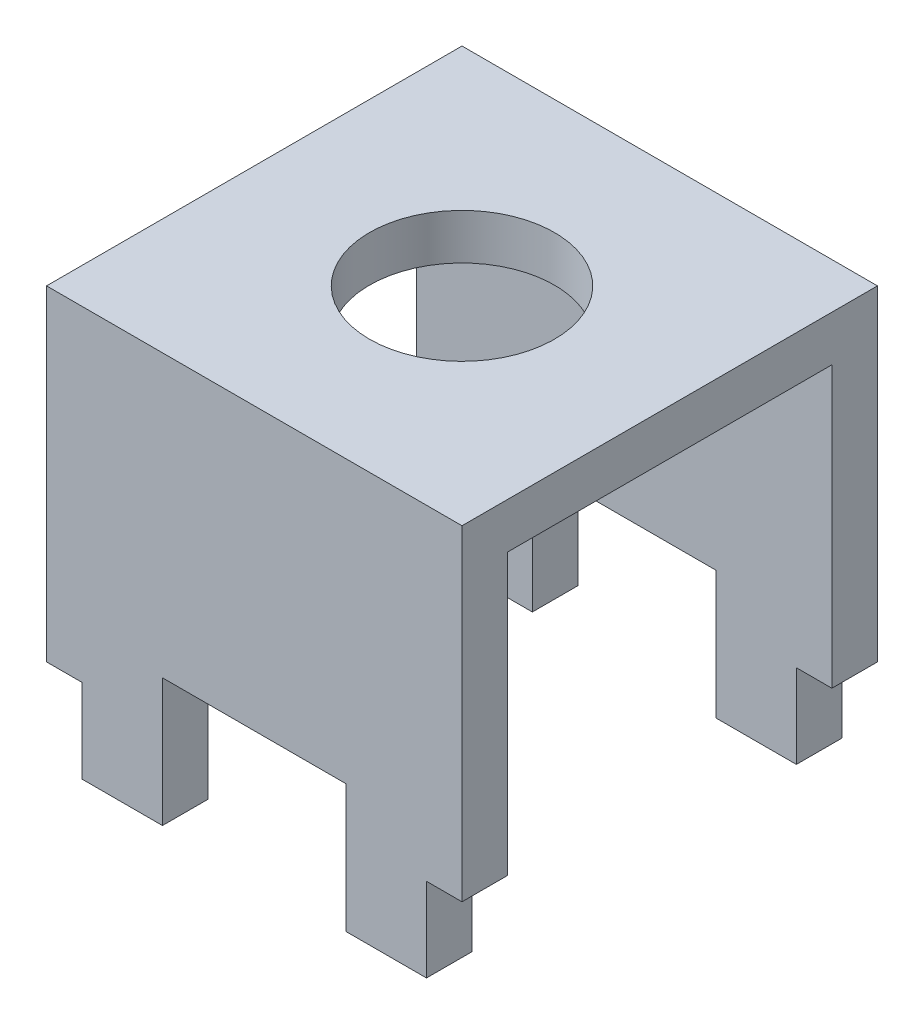
ISO-10303-21;
HEADER;
FILE_DESCRIPTION(('STEP AP214'),'2;1');
FILE_NAME('part.step','',(''),(''),'','','');
FILE_SCHEMA(('AUTOMOTIVE_DESIGN { 1 0 10303 214 1 1 1 1 }'));
ENDSEC;
DATA;
#1=APPLICATION_CONTEXT('core data for automotive mechanical design processes');
#2=APPLICATION_PROTOCOL_DEFINITION('international standard','automotive_design',2000,#1);
#3=PRODUCT_CONTEXT('',#1,'mechanical');
#4=PRODUCT('Part','Part','',(#3));
#5=PRODUCT_RELATED_PRODUCT_CATEGORY('part','',(#4));
#6=PRODUCT_DEFINITION_FORMATION('','',#4);
#7=PRODUCT_DEFINITION_CONTEXT('part definition',#1,'design');
#8=PRODUCT_DEFINITION('design','',#6,#7);
#9=PRODUCT_DEFINITION_SHAPE('','',#8);
#10=(LENGTH_UNIT() NAMED_UNIT(*) SI_UNIT(.MILLI.,.METRE.));
#11=(NAMED_UNIT(*) PLANE_ANGLE_UNIT() SI_UNIT($,.RADIAN.));
#12=(NAMED_UNIT(*) SI_UNIT($,.STERADIAN.) SOLID_ANGLE_UNIT());
#13=UNCERTAINTY_MEASURE_WITH_UNIT(LENGTH_MEASURE(1.E-05),#10,'distance_accuracy_value','');
#14=(GEOMETRIC_REPRESENTATION_CONTEXT(3) GLOBAL_UNCERTAINTY_ASSIGNED_CONTEXT((#13)) GLOBAL_UNIT_ASSIGNED_CONTEXT((#10,
#11,#12)) REPRESENTATION_CONTEXT('',''));
#15=CARTESIAN_POINT('',(0.,0.,0.));
#16=DIRECTION('',(0.,0.,1.));
#17=DIRECTION('',(1.,0.,0.));
#18=AXIS2_PLACEMENT_3D('',#15,#16,#17);
#19=CARTESIAN_POINT('',(-1.7399,5.842,-6.35));
#20=DIRECTION('',(-1.,0.,0.));
#21=DIRECTION('',(0.,0.,1.));
#22=AXIS2_PLACEMENT_3D('',#19,#20,#21);
#23=PLANE('',#22);
#24=DIRECTION('',(0.,1.,0.));
#25=VECTOR('',#24,1.);
#26=CARTESIAN_POINT('',(-1.7399,0.,-3.0734));
#27=LINE('',#26,#25);
#28=CARTESIAN_POINT('',(-1.7399,5.842,-3.0734));
#29=VERTEX_POINT('',#28);
#30=CARTESIAN_POINT('',(-1.7399,3.4163,-3.0734));
#31=VERTEX_POINT('',#30);
#32=EDGE_CURVE('E348',#29,#31,#27,.F.);
#33=ORIENTED_EDGE('',*,*,#32,.T.);
#34=DIRECTION('',(0.,0.,1.));
#35=VECTOR('',#34,1.);
#36=CARTESIAN_POINT('',(-1.7399,3.4163,-5.1317219367007));
#37=LINE('',#36,#35);
#38=CARTESIAN_POINT('',(-1.7399,3.4163,-3.937));
#39=VERTEX_POINT('',#38);
#40=EDGE_CURVE('E228',#31,#39,#37,.F.);
#41=ORIENTED_EDGE('',*,*,#40,.T.);
#42=DIRECTION('',(0.,1.,0.));
#43=VECTOR('',#42,1.);
#44=CARTESIAN_POINT('',(-1.7399,0.,-3.937));
#45=LINE('',#44,#43);
#46=CARTESIAN_POINT('',(-1.7399,5.842,-3.937));
#47=VERTEX_POINT('',#46);
#48=EDGE_CURVE('E323',#47,#39,#45,.F.);
#49=ORIENTED_EDGE('',*,*,#48,.F.);
#50=DIRECTION('',(0.,0.,1.));
#51=VECTOR('',#50,1.);
#52=CARTESIAN_POINT('',(-1.7399,5.842,-6.35));
#53=LINE('',#52,#51);
#54=EDGE_CURVE('E218',#47,#29,#53,.T.);
#55=ORIENTED_EDGE('',*,*,#54,.T.);
#56=EDGE_LOOP('',(#33,#41,#49,#55));
#57=FACE_BOUND('',#56,.T.);
#58=ADVANCED_FACE('F16',(#57),#23,.F.);
#59=CARTESIAN_POINT('',(3.937,3.4163,-5.1317219367007));
#60=DIRECTION('',(0.,1.,0.));
#61=DIRECTION('',(0.,0.,1.));
#62=AXIS2_PLACEMENT_3D('',#59,#60,#61);
#63=PLANE('',#62);
#64=DIRECTION('',(0.,0.,-1.));
#65=VECTOR('',#64,1.);
#66=CARTESIAN_POINT('',(-3.2639,3.4163,-6.35));
#67=LINE('',#66,#65);
#68=CARTESIAN_POINT('',(-3.2639,3.4163,-3.0734));
#69=VERTEX_POINT('',#68);
#70=CARTESIAN_POINT('',(-3.2639,3.4163,-3.937));
#71=VERTEX_POINT('',#70);
#72=EDGE_CURVE('E226',#69,#71,#67,.T.);
#73=ORIENTED_EDGE('',*,*,#72,.T.);
#74=DIRECTION('',(-1.,0.,0.));
#75=VECTOR('',#74,1.);
#76=CARTESIAN_POINT('',(-3.937,3.4163,-3.937));
#77=LINE('',#76,#75);
#78=EDGE_CURVE('E320',#39,#71,#77,.T.);
#79=ORIENTED_EDGE('',*,*,#78,.F.);
#80=ORIENTED_EDGE('',*,*,#40,.F.);
#81=DIRECTION('',(-1.,0.,0.));
#82=VECTOR('',#81,1.);
#83=CARTESIAN_POINT('',(-6.35,3.4163,-3.0734));
#84=LINE('',#83,#82);
#85=EDGE_CURVE('E346',#31,#69,#84,.T.);
#86=ORIENTED_EDGE('',*,*,#85,.T.);
#87=EDGE_LOOP('',(#73,#79,#80,#86));
#88=FACE_BOUND('',#87,.T.);
#89=ADVANCED_FACE('F617',(#88),#63,.F.);
#90=CARTESIAN_POINT('',(-3.2639,0.,-6.35));
#91=DIRECTION('',(1.,0.,0.));
#92=DIRECTION('',(0.,0.,-1.));
#93=AXIS2_PLACEMENT_3D('',#90,#91,#92);
#94=PLANE('',#93);
#95=DIRECTION('',(0.,1.,0.));
#96=VECTOR('',#95,1.);
#97=CARTESIAN_POINT('',(-3.2639,0.,-3.937));
#98=LINE('',#97,#96);
#99=CARTESIAN_POINT('',(-3.2639,5.0038,-3.937));
#100=VERTEX_POINT('',#99);
#101=EDGE_CURVE('E317',#71,#100,#98,.T.);
#102=ORIENTED_EDGE('',*,*,#101,.F.);
#103=ORIENTED_EDGE('',*,*,#72,.F.);
#104=DIRECTION('',(0.,1.,0.));
#105=VECTOR('',#104,1.);
#106=CARTESIAN_POINT('',(-3.2639,0.,-3.0734));
#107=LINE('',#106,#105);
#108=CARTESIAN_POINT('',(-3.2639,5.0038,-3.0734));
#109=VERTEX_POINT('',#108);
#110=EDGE_CURVE('E344',#69,#109,#107,.T.);
#111=ORIENTED_EDGE('',*,*,#110,.T.);
#112=DIRECTION('',(0.,0.,1.));
#113=VECTOR('',#112,1.);
#114=CARTESIAN_POINT('',(-3.2639,5.0038,-6.35));
#115=LINE('',#114,#113);
#116=EDGE_CURVE('E195',#109,#100,#115,.F.);
#117=ORIENTED_EDGE('',*,*,#116,.T.);
#118=EDGE_LOOP('',(#102,#103,#111,#117));
#119=FACE_BOUND('',#118,.T.);
#120=ADVANCED_FACE('F608',(#119),#94,.F.);
#121=CARTESIAN_POINT('',(3.2639,5.0038,-6.35));
#122=DIRECTION('',(-1.,0.,0.));
#123=DIRECTION('',(0.,0.,1.));
#124=AXIS2_PLACEMENT_3D('',#121,#122,#123);
#125=PLANE('',#124);
#126=DIRECTION('',(0.,1.,0.));
#127=VECTOR('',#126,1.);
#128=CARTESIAN_POINT('',(3.2639,0.,-3.0734));
#129=LINE('',#128,#127);
#130=CARTESIAN_POINT('',(3.2639,5.0038,-3.0734));
#131=VERTEX_POINT('',#130);
#132=CARTESIAN_POINT('',(3.2639,3.4163,-3.0734));
#133=VERTEX_POINT('',#132);
#134=EDGE_CURVE('E338',#131,#133,#129,.F.);
#135=ORIENTED_EDGE('',*,*,#134,.T.);
#136=DIRECTION('',(0.,0.,1.));
#137=VECTOR('',#136,1.);
#138=CARTESIAN_POINT('',(3.2639,3.4163,-5.1317219367007));
#139=LINE('',#138,#137);
#140=CARTESIAN_POINT('',(3.2639,3.4163,-3.937));
#141=VERTEX_POINT('',#140);
#142=EDGE_CURVE('E224',#133,#141,#139,.F.);
#143=ORIENTED_EDGE('',*,*,#142,.T.);
#144=DIRECTION('',(0.,1.,0.));
#145=VECTOR('',#144,1.);
#146=CARTESIAN_POINT('',(3.2639,0.,-3.937));
#147=LINE('',#146,#145);
#148=CARTESIAN_POINT('',(3.2639,5.0038,-3.937));
#149=VERTEX_POINT('',#148);
#150=EDGE_CURVE('E308',#149,#141,#147,.F.);
#151=ORIENTED_EDGE('',*,*,#150,.F.);
#152=DIRECTION('',(0.,0.,1.));
#153=VECTOR('',#152,1.);
#154=CARTESIAN_POINT('',(3.2639,5.0038,-6.35));
#155=LINE('',#154,#153);
#156=EDGE_CURVE('E326',#149,#131,#155,.T.);
#157=ORIENTED_EDGE('',*,*,#156,.T.);
#158=EDGE_LOOP('',(#135,#143,#151,#157));
#159=FACE_BOUND('',#158,.T.);
#160=ADVANCED_FACE('F599',(#159),#125,.F.);
#161=CARTESIAN_POINT('',(3.937,3.4163,-5.1317219367007));
#162=DIRECTION('',(0.,1.,0.));
#163=DIRECTION('',(0.,0.,1.));
#164=AXIS2_PLACEMENT_3D('',#161,#162,#163);
#165=PLANE('',#164);
#166=DIRECTION('',(0.,0.,-1.));
#167=VECTOR('',#166,1.);
#168=CARTESIAN_POINT('',(1.7399,3.4163,-6.35));
#169=LINE('',#168,#167);
#170=CARTESIAN_POINT('',(1.7399,3.4163,-3.0734));
#171=VERTEX_POINT('',#170);
#172=CARTESIAN_POINT('',(1.7399,3.4163,-3.937));
#173=VERTEX_POINT('',#172);
#174=EDGE_CURVE('E222',#171,#173,#169,.T.);
#175=ORIENTED_EDGE('',*,*,#174,.T.);
#176=DIRECTION('',(-1.,0.,0.));
#177=VECTOR('',#176,1.);
#178=CARTESIAN_POINT('',(-3.937,3.4163,-3.937));
#179=LINE('',#178,#177);
#180=EDGE_CURVE('E305',#141,#173,#179,.T.);
#181=ORIENTED_EDGE('',*,*,#180,.F.);
#182=ORIENTED_EDGE('',*,*,#142,.F.);
#183=DIRECTION('',(-1.,0.,0.));
#184=VECTOR('',#183,1.);
#185=CARTESIAN_POINT('',(-6.35,3.4163,-3.0734));
#186=LINE('',#185,#184);
#187=EDGE_CURVE('E336',#133,#171,#186,.T.);
#188=ORIENTED_EDGE('',*,*,#187,.T.);
#189=EDGE_LOOP('',(#175,#181,#182,#188));
#190=FACE_BOUND('',#189,.T.);
#191=ADVANCED_FACE('F590',(#190),#165,.F.);
#192=CARTESIAN_POINT('',(1.7399,0.,-6.35));
#193=DIRECTION('',(1.,0.,0.));
#194=DIRECTION('',(0.,0.,-1.));
#195=AXIS2_PLACEMENT_3D('',#192,#193,#194);
#196=PLANE('',#195);
#197=DIRECTION('',(0.,1.,0.));
#198=VECTOR('',#197,1.);
#199=CARTESIAN_POINT('',(1.7399,0.,-3.937));
#200=LINE('',#199,#198);
#201=CARTESIAN_POINT('',(1.7399,5.842,-3.937));
#202=VERTEX_POINT('',#201);
#203=EDGE_CURVE('E302',#173,#202,#200,.T.);
#204=ORIENTED_EDGE('',*,*,#203,.F.);
#205=ORIENTED_EDGE('',*,*,#174,.F.);
#206=DIRECTION('',(0.,1.,0.));
#207=VECTOR('',#206,1.);
#208=CARTESIAN_POINT('',(1.7399,0.,-3.0734));
#209=LINE('',#208,#207);
#210=CARTESIAN_POINT('',(1.7399,5.842,-3.0734));
#211=VERTEX_POINT('',#210);
#212=EDGE_CURVE('E334',#171,#211,#209,.T.);
#213=ORIENTED_EDGE('',*,*,#212,.T.);
#214=DIRECTION('',(0.,0.,1.));
#215=VECTOR('',#214,1.);
#216=CARTESIAN_POINT('',(1.7399,5.842,-6.35));
#217=LINE('',#216,#215);
#218=EDGE_CURVE('E220',#211,#202,#217,.F.);
#219=ORIENTED_EDGE('',*,*,#218,.T.);
#220=EDGE_LOOP('',(#204,#205,#213,#219));
#221=FACE_BOUND('',#220,.T.);
#222=ADVANCED_FACE('F581',(#221),#196,.F.);
#223=CARTESIAN_POINT('',(1.7399,5.842,-6.35));
#224=DIRECTION('',(0.,1.,0.));
#225=DIRECTION('',(0.,0.,1.));
#226=AXIS2_PLACEMENT_3D('',#223,#224,#225);
#227=PLANE('',#226);
#228=ORIENTED_EDGE('',*,*,#54,.F.);
#229=DIRECTION('',(-1.,0.,0.));
#230=VECTOR('',#229,1.);
#231=CARTESIAN_POINT('',(-3.937,5.842,-3.937));
#232=LINE('',#231,#230);
#233=EDGE_CURVE('E299',#202,#47,#232,.T.);
#234=ORIENTED_EDGE('',*,*,#233,.F.);
#235=ORIENTED_EDGE('',*,*,#218,.F.);
#236=DIRECTION('',(-1.,0.,0.));
#237=VECTOR('',#236,1.);
#238=CARTESIAN_POINT('',(-6.35,5.842,-3.0734));
#239=LINE('',#238,#237);
#240=EDGE_CURVE('E331',#211,#29,#239,.T.);
#241=ORIENTED_EDGE('',*,*,#240,.T.);
#242=EDGE_LOOP('',(#228,#234,#235,#241));
#243=FACE_BOUND('',#242,.T.);
#244=ADVANCED_FACE('F572',(#243),#227,.F.);
#245=CARTESIAN_POINT('',(-3.2639,5.0038,-6.35));
#246=DIRECTION('',(0.,1.,0.));
#247=DIRECTION('',(0.,0.,1.));
#248=AXIS2_PLACEMENT_3D('',#245,#246,#247);
#249=PLANE('',#248);
#250=DIRECTION('',(-1.,0.,0.));
#251=VECTOR('',#250,1.);
#252=CARTESIAN_POINT('',(-6.35,5.0038,-3.0734));
#253=LINE('',#252,#251);
#254=CARTESIAN_POINT('',(-3.937,5.0038,-3.0734));
#255=VERTEX_POINT('',#254);
#256=EDGE_CURVE('E342',#109,#255,#253,.T.);
#257=ORIENTED_EDGE('',*,*,#256,.T.);
#258=DIRECTION('',(0.,0.,-1.));
#259=VECTOR('',#258,1.);
#260=CARTESIAN_POINT('',(-3.937,5.0038,0.));
#261=LINE('',#260,#259);
#262=CARTESIAN_POINT('',(-3.937,5.0038,-3.937));
#263=VERTEX_POINT('',#262);
#264=EDGE_CURVE('E288',#255,#263,#261,.T.);
#265=ORIENTED_EDGE('',*,*,#264,.T.);
#266=DIRECTION('',(-1.,0.,0.));
#267=VECTOR('',#266,1.);
#268=CARTESIAN_POINT('',(-3.937,5.0038,-3.937));
#269=LINE('',#268,#267);
#270=EDGE_CURVE('E314',#100,#263,#269,.T.);
#271=ORIENTED_EDGE('',*,*,#270,.F.);
#272=ORIENTED_EDGE('',*,*,#116,.F.);
#273=EDGE_LOOP('',(#257,#265,#271,#272));
#274=FACE_BOUND('',#273,.T.);
#275=ADVANCED_FACE('F564',(#274),#249,.F.);
#276=CARTESIAN_POINT('',(-3.2639,0.,-6.35));
#277=DIRECTION('',(1.,0.,0.));
#278=DIRECTION('',(0.,0.,-1.));
#279=AXIS2_PLACEMENT_3D('',#276,#277,#278);
#280=PLANE('',#279);
#281=DIRECTION('',(0.,1.,0.));
#282=VECTOR('',#281,1.);
#283=CARTESIAN_POINT('',(-3.2639,10.3124,3.0734));
#284=LINE('',#283,#282);
#285=CARTESIAN_POINT('',(-3.2639,5.0038,3.0734));
#286=VERTEX_POINT('',#285);
#287=CARTESIAN_POINT('',(-3.2639,3.4163,3.0734));
#288=VERTEX_POINT('',#287);
#289=EDGE_CURVE('E177',#286,#288,#284,.F.);
#290=ORIENTED_EDGE('',*,*,#289,.T.);
#291=DIRECTION('',(0.,0.,1.));
#292=VECTOR('',#291,1.);
#293=CARTESIAN_POINT('',(-3.2639,3.4163,-5.1317219367007));
#294=LINE('',#293,#292);
#295=CARTESIAN_POINT('',(-3.2639,3.4163,3.937));
#296=VERTEX_POINT('',#295);
#297=EDGE_CURVE('E180',#288,#296,#294,.T.);
#298=ORIENTED_EDGE('',*,*,#297,.T.);
#299=DIRECTION('',(0.,1.,0.));
#300=VECTOR('',#299,1.);
#301=CARTESIAN_POINT('',(-3.2639,11.176,3.937));
#302=LINE('',#301,#300);
#303=CARTESIAN_POINT('',(-3.2639,5.0038,3.937));
#304=VERTEX_POINT('',#303);
#305=EDGE_CURVE('E284',#304,#296,#302,.F.);
#306=ORIENTED_EDGE('',*,*,#305,.F.);
#307=DIRECTION('',(0.,0.,1.));
#308=VECTOR('',#307,1.);
#309=CARTESIAN_POINT('',(-3.2639,5.0038,-6.35));
#310=LINE('',#309,#308);
#311=EDGE_CURVE('E174',#304,#286,#310,.F.);
#312=ORIENTED_EDGE('',*,*,#311,.T.);
#313=EDGE_LOOP('',(#290,#298,#306,#312));
#314=FACE_BOUND('',#313,.T.);
#315=ADVANCED_FACE('F179',(#314),#280,.F.);
#316=CARTESIAN_POINT('',(3.937,3.4163,-5.1317219367007));
#317=DIRECTION('',(0.,1.,0.));
#318=DIRECTION('',(0.,0.,1.));
#319=AXIS2_PLACEMENT_3D('',#316,#317,#318);
#320=PLANE('',#319);
#321=DIRECTION('',(0.,0.,1.));
#322=VECTOR('',#321,1.);
#323=CARTESIAN_POINT('',(-1.7399,3.4163,-6.35));
#324=LINE('',#323,#322);
#325=CARTESIAN_POINT('',(-1.7399,3.4163,3.0734));
#326=VERTEX_POINT('',#325);
#327=CARTESIAN_POINT('',(-1.7399,3.4163,3.937));
#328=VERTEX_POINT('',#327);
#329=EDGE_CURVE('E194',#326,#328,#324,.T.);
#330=ORIENTED_EDGE('',*,*,#329,.T.);
#331=DIRECTION('',(1.,0.,0.));
#332=VECTOR('',#331,1.);
#333=CARTESIAN_POINT('',(-3.937,3.4163,3.937));
#334=LINE('',#333,#332);
#335=EDGE_CURVE('E192',#296,#328,#334,.T.);
#336=ORIENTED_EDGE('',*,*,#335,.F.);
#337=ORIENTED_EDGE('',*,*,#297,.F.);
#338=DIRECTION('',(1.,0.,0.));
#339=VECTOR('',#338,1.);
#340=CARTESIAN_POINT('',(-6.35,3.4163,3.0734));
#341=LINE('',#340,#339);
#342=EDGE_CURVE('E185',#288,#326,#341,.T.);
#343=ORIENTED_EDGE('',*,*,#342,.T.);
#344=EDGE_LOOP('',(#330,#336,#337,#343));
#345=FACE_BOUND('',#344,.T.);
#346=ADVANCED_FACE('F189',(#345),#320,.F.);
#347=CARTESIAN_POINT('',(-1.7399,5.842,-6.35));
#348=DIRECTION('',(-1.,0.,0.));
#349=DIRECTION('',(0.,0.,1.));
#350=AXIS2_PLACEMENT_3D('',#347,#348,#349);
#351=PLANE('',#350);
#352=DIRECTION('',(0.,1.,0.));
#353=VECTOR('',#352,1.);
#354=CARTESIAN_POINT('',(-1.7399,11.176,3.937));
#355=LINE('',#354,#353);
#356=CARTESIAN_POINT('',(-1.7399,5.842,3.937));
#357=VERTEX_POINT('',#356);
#358=EDGE_CURVE('E280',#328,#357,#355,.T.);
#359=ORIENTED_EDGE('',*,*,#358,.F.);
#360=ORIENTED_EDGE('',*,*,#329,.F.);
#361=DIRECTION('',(0.,1.,0.));
#362=VECTOR('',#361,1.);
#363=CARTESIAN_POINT('',(-1.7399,10.3124,3.0734));
#364=LINE('',#363,#362);
#365=CARTESIAN_POINT('',(-1.7399,5.842,3.0734));
#366=VERTEX_POINT('',#365);
#367=EDGE_CURVE('E200',#326,#366,#364,.T.);
#368=ORIENTED_EDGE('',*,*,#367,.T.);
#369=DIRECTION('',(0.,0.,1.));
#370=VECTOR('',#369,1.);
#371=CARTESIAN_POINT('',(-1.7399,5.842,-6.35));
#372=LINE('',#371,#370);
#373=EDGE_CURVE('E214',#366,#357,#372,.T.);
#374=ORIENTED_EDGE('',*,*,#373,.T.);
#375=EDGE_LOOP('',(#359,#360,#368,#374));
#376=FACE_BOUND('',#375,.T.);
#377=ADVANCED_FACE('F386',(#376),#351,.F.);
#378=CARTESIAN_POINT('',(1.7399,5.842,-6.35));
#379=DIRECTION('',(0.,1.,0.));
#380=DIRECTION('',(0.,0.,1.));
#381=AXIS2_PLACEMENT_3D('',#378,#379,#380);
#382=PLANE('',#381);
#383=DIRECTION('',(0.,0.,-1.));
#384=VECTOR('',#383,1.);
#385=CARTESIAN_POINT('',(1.7399,5.842,-6.35));
#386=LINE('',#385,#384);
#387=CARTESIAN_POINT('',(1.7399,5.842,3.0734));
#388=VERTEX_POINT('',#387);
#389=CARTESIAN_POINT('',(1.7399,5.842,3.937));
#390=VERTEX_POINT('',#389);
#391=EDGE_CURVE('E212',#388,#390,#386,.F.);
#392=ORIENTED_EDGE('',*,*,#391,.T.);
#393=DIRECTION('',(1.,0.,0.));
#394=VECTOR('',#393,1.);
#395=CARTESIAN_POINT('',(-3.937,5.842,3.937));
#396=LINE('',#395,#394);
#397=EDGE_CURVE('E277',#357,#390,#396,.T.);
#398=ORIENTED_EDGE('',*,*,#397,.F.);
#399=ORIENTED_EDGE('',*,*,#373,.F.);
#400=DIRECTION('',(1.,0.,0.));
#401=VECTOR('',#400,1.);
#402=CARTESIAN_POINT('',(-6.35,5.842,3.0734));
#403=LINE('',#402,#401);
#404=EDGE_CURVE('E202',#366,#388,#403,.T.);
#405=ORIENTED_EDGE('',*,*,#404,.T.);
#406=EDGE_LOOP('',(#392,#398,#399,#405));
#407=FACE_BOUND('',#406,.T.);
#408=ADVANCED_FACE('F364',(#407),#382,.F.);
#409=CARTESIAN_POINT('',(1.7399,0.,-6.35));
#410=DIRECTION('',(1.,0.,0.));
#411=DIRECTION('',(0.,0.,-1.));
#412=AXIS2_PLACEMENT_3D('',#409,#410,#411);
#413=PLANE('',#412);
#414=DIRECTION('',(0.,1.,0.));
#415=VECTOR('',#414,1.);
#416=CARTESIAN_POINT('',(1.7399,10.3124,3.0734));
#417=LINE('',#416,#415);
#418=CARTESIAN_POINT('',(1.7399,3.4163,3.0734));
#419=VERTEX_POINT('',#418);
#420=EDGE_CURVE('E360',#388,#419,#417,.F.);
#421=ORIENTED_EDGE('',*,*,#420,.T.);
#422=DIRECTION('',(0.,0.,1.));
#423=VECTOR('',#422,1.);
#424=CARTESIAN_POINT('',(1.7399,3.4163,-5.1317219367007));
#425=LINE('',#424,#423);
#426=CARTESIAN_POINT('',(1.7399,3.4163,3.937));
#427=VERTEX_POINT('',#426);
#428=EDGE_CURVE('E210',#419,#427,#425,.T.);
#429=ORIENTED_EDGE('',*,*,#428,.T.);
#430=DIRECTION('',(0.,1.,0.));
#431=VECTOR('',#430,1.);
#432=CARTESIAN_POINT('',(1.7399,11.176,3.937));
#433=LINE('',#432,#431);
#434=EDGE_CURVE('E274',#390,#427,#433,.F.);
#435=ORIENTED_EDGE('',*,*,#434,.F.);
#436=ORIENTED_EDGE('',*,*,#391,.F.);
#437=EDGE_LOOP('',(#421,#429,#435,#436));
#438=FACE_BOUND('',#437,.T.);
#439=ADVANCED_FACE('F369',(#438),#413,.F.);
#440=CARTESIAN_POINT('',(3.937,3.4163,-5.1317219367007));
#441=DIRECTION('',(0.,1.,0.));
#442=DIRECTION('',(0.,0.,1.));
#443=AXIS2_PLACEMENT_3D('',#440,#441,#442);
#444=PLANE('',#443);
#445=DIRECTION('',(0.,0.,1.));
#446=VECTOR('',#445,1.);
#447=CARTESIAN_POINT('',(3.2639,3.4163,-6.35));
#448=LINE('',#447,#446);
#449=CARTESIAN_POINT('',(3.2639,3.4163,3.0734));
#450=VERTEX_POINT('',#449);
#451=CARTESIAN_POINT('',(3.2639,3.4163,3.937));
#452=VERTEX_POINT('',#451);
#453=EDGE_CURVE('E208',#450,#452,#448,.T.);
#454=ORIENTED_EDGE('',*,*,#453,.T.);
#455=DIRECTION('',(1.,0.,0.));
#456=VECTOR('',#455,1.);
#457=CARTESIAN_POINT('',(-3.937,3.4163,3.937));
#458=LINE('',#457,#456);
#459=EDGE_CURVE('E271',#427,#452,#458,.T.);
#460=ORIENTED_EDGE('',*,*,#459,.F.);
#461=ORIENTED_EDGE('',*,*,#428,.F.);
#462=DIRECTION('',(1.,0.,0.));
#463=VECTOR('',#462,1.);
#464=CARTESIAN_POINT('',(-6.35,3.4163,3.0734));
#465=LINE('',#464,#463);
#466=EDGE_CURVE('E358',#419,#450,#465,.T.);
#467=ORIENTED_EDGE('',*,*,#466,.T.);
#468=EDGE_LOOP('',(#454,#460,#461,#467));
#469=FACE_BOUND('',#468,.T.);
#470=ADVANCED_FACE('F376',(#469),#444,.F.);
#471=CARTESIAN_POINT('',(3.2639,5.0038,-6.35));
#472=DIRECTION('',(-1.,0.,0.));
#473=DIRECTION('',(0.,0.,1.));
#474=AXIS2_PLACEMENT_3D('',#471,#472,#473);
#475=PLANE('',#474);
#476=DIRECTION('',(0.,1.,0.));
#477=VECTOR('',#476,1.);
#478=CARTESIAN_POINT('',(3.2639,11.176,3.937));
#479=LINE('',#478,#477);
#480=CARTESIAN_POINT('',(3.2639,5.0038,3.937));
#481=VERTEX_POINT('',#480);
#482=EDGE_CURVE('E268',#452,#481,#479,.T.);
#483=ORIENTED_EDGE('',*,*,#482,.F.);
#484=ORIENTED_EDGE('',*,*,#453,.F.);
#485=DIRECTION('',(0.,1.,0.));
#486=VECTOR('',#485,1.);
#487=CARTESIAN_POINT('',(3.2639,10.3124,3.0734));
#488=LINE('',#487,#486);
#489=CARTESIAN_POINT('',(3.2639,5.0038,3.0734));
#490=VERTEX_POINT('',#489);
#491=EDGE_CURVE('E356',#450,#490,#488,.T.);
#492=ORIENTED_EDGE('',*,*,#491,.T.);
#493=DIRECTION('',(0.,0.,1.));
#494=VECTOR('',#493,1.);
#495=CARTESIAN_POINT('',(3.2639,5.0038,-6.35));
#496=LINE('',#495,#494);
#497=EDGE_CURVE('E186',#490,#481,#496,.T.);
#498=ORIENTED_EDGE('',*,*,#497,.T.);
#499=EDGE_LOOP('',(#483,#484,#492,#498));
#500=FACE_BOUND('',#499,.T.);
#501=ADVANCED_FACE('F380',(#500),#475,.F.);
#502=CARTESIAN_POINT('',(-3.2639,5.0038,-6.35));
#503=DIRECTION('',(0.,1.,0.));
#504=DIRECTION('',(0.,0.,1.));
#505=AXIS2_PLACEMENT_3D('',#502,#503,#504);
#506=PLANE('',#505);
#507=DIRECTION('',(1.,0.,0.));
#508=VECTOR('',#507,1.);
#509=CARTESIAN_POINT('',(-3.937,5.0038,3.937));
#510=LINE('',#509,#508);
#511=CARTESIAN_POINT('',(-3.937,5.0038,3.937));
#512=VERTEX_POINT('',#511);
#513=EDGE_CURVE('E260',#512,#304,#510,.T.);
#514=ORIENTED_EDGE('',*,*,#513,.F.);
#515=DIRECTION('',(0.,0.,-1.));
#516=VECTOR('',#515,1.);
#517=CARTESIAN_POINT('',(-3.937,5.0038,0.));
#518=LINE('',#517,#516);
#519=CARTESIAN_POINT('',(-3.937,5.0038,3.0734));
#520=VERTEX_POINT('',#519);
#521=EDGE_CURVE('E297',#512,#520,#518,.T.);
#522=ORIENTED_EDGE('',*,*,#521,.T.);
#523=DIRECTION('',(1.,0.,0.));
#524=VECTOR('',#523,1.);
#525=CARTESIAN_POINT('',(-6.35,5.0038,3.0734));
#526=LINE('',#525,#524);
#527=EDGE_CURVE('E352',#520,#286,#526,.T.);
#528=ORIENTED_EDGE('',*,*,#527,.T.);
#529=ORIENTED_EDGE('',*,*,#311,.F.);
#530=EDGE_LOOP('',(#514,#522,#528,#529));
#531=FACE_BOUND('',#530,.T.);
#532=ADVANCED_FACE('F438',(#531),#506,.F.);
#533=CARTESIAN_POINT('',(3.937,5.0038,-6.35));
#534=DIRECTION('',(0.,1.,0.));
#535=DIRECTION('',(0.,0.,1.));
#536=AXIS2_PLACEMENT_3D('',#533,#534,#535);
#537=PLANE('',#536);
#538=DIRECTION('',(1.,0.,0.));
#539=VECTOR('',#538,1.);
#540=CARTESIAN_POINT('',(-6.35,5.0038,3.0734));
#541=LINE('',#540,#539);
#542=CARTESIAN_POINT('',(3.937,5.0038,3.0734));
#543=VERTEX_POINT('',#542);
#544=EDGE_CURVE('E354',#490,#543,#541,.T.);
#545=ORIENTED_EDGE('',*,*,#544,.T.);
#546=DIRECTION('',(0.,0.,-1.));
#547=VECTOR('',#546,1.);
#548=CARTESIAN_POINT('',(3.937,5.0038,0.));
#549=LINE('',#548,#547);
#550=CARTESIAN_POINT('',(3.937,5.0038,3.937));
#551=VERTEX_POINT('',#550);
#552=EDGE_CURVE('E256',#551,#543,#549,.T.);
#553=ORIENTED_EDGE('',*,*,#552,.F.);
#554=DIRECTION('',(1.,0.,0.));
#555=VECTOR('',#554,1.);
#556=CARTESIAN_POINT('',(-3.937,5.0038,3.937));
#557=LINE('',#556,#555);
#558=EDGE_CURVE('E266',#481,#551,#557,.T.);
#559=ORIENTED_EDGE('',*,*,#558,.F.);
#560=ORIENTED_EDGE('',*,*,#497,.F.);
#561=EDGE_LOOP('',(#545,#553,#559,#560));
#562=FACE_BOUND('',#561,.T.);
#563=ADVANCED_FACE('F435',(#562),#537,.F.);
#564=CARTESIAN_POINT('',(-6.35,10.3124,3.0734));
#565=DIRECTION('',(0.,0.,1.));
#566=DIRECTION('',(1.,0.,0.));
#567=AXIS2_PLACEMENT_3D('',#564,#565,#566);
#568=PLANE('',#567);
#569=DIRECTION('',(0.,1.,0.));
#570=VECTOR('',#569,1.);
#571=CARTESIAN_POINT('',(-3.937,0.,3.0734));
#572=LINE('',#571,#570);
#573=CARTESIAN_POINT('',(-3.937,10.3124,3.0734));
#574=VERTEX_POINT('',#573);
#575=EDGE_CURVE('E295',#520,#574,#572,.T.);
#576=ORIENTED_EDGE('',*,*,#575,.T.);
#577=DIRECTION('',(1.,0.,0.));
#578=VECTOR('',#577,1.);
#579=CARTESIAN_POINT('',(-6.35,10.3124,3.0734));
#580=LINE('',#579,#578);
#581=CARTESIAN_POINT('',(3.937,10.3124,3.0734));
#582=VERTEX_POINT('',#581);
#583=EDGE_CURVE('E350',#574,#582,#580,.T.);
#584=ORIENTED_EDGE('',*,*,#583,.T.);
#585=DIRECTION('',(0.,1.,0.));
#586=VECTOR('',#585,1.);
#587=CARTESIAN_POINT('',(3.937,0.,3.0734));
#588=LINE('',#587,#586);
#589=EDGE_CURVE('E253',#543,#582,#588,.T.);
#590=ORIENTED_EDGE('',*,*,#589,.F.);
#591=ORIENTED_EDGE('',*,*,#544,.F.);
#592=ORIENTED_EDGE('',*,*,#491,.F.);
#593=ORIENTED_EDGE('',*,*,#466,.F.);
#594=ORIENTED_EDGE('',*,*,#420,.F.);
#595=ORIENTED_EDGE('',*,*,#404,.F.);
#596=ORIENTED_EDGE('',*,*,#367,.F.);
#597=ORIENTED_EDGE('',*,*,#342,.F.);
#598=ORIENTED_EDGE('',*,*,#289,.F.);
#599=ORIENTED_EDGE('',*,*,#527,.F.);
#600=EDGE_LOOP('',(#576,#584,#590,#591,#592,#593,#594,#595,#596,#597,#598,#599));
#601=FACE_BOUND('',#600,.T.);
#602=ADVANCED_FACE('F198',(#601),#568,.F.);
#603=CARTESIAN_POINT('',(-6.35,10.3124,-3.0734));
#604=DIRECTION('',(0.,1.,0.));
#605=DIRECTION('',(0.,0.,1.));
#606=AXIS2_PLACEMENT_3D('',#603,#604,#605);
#607=PLANE('',#606);
#608=ORIENTED_EDGE('',*,*,#583,.F.);
#609=DIRECTION('',(0.,0.,-1.));
#610=VECTOR('',#609,1.);
#611=CARTESIAN_POINT('',(-3.937,10.3124,0.));
#612=LINE('',#611,#610);
#613=CARTESIAN_POINT('',(-3.937,10.3124,-3.0734));
#614=VERTEX_POINT('',#613);
#615=EDGE_CURVE('E293',#574,#614,#612,.T.);
#616=ORIENTED_EDGE('',*,*,#615,.T.);
#617=DIRECTION('',(-1.,0.,0.));
#618=VECTOR('',#617,1.);
#619=CARTESIAN_POINT('',(-6.35,10.3124,-3.0734));
#620=LINE('',#619,#618);
#621=CARTESIAN_POINT('',(3.937,10.3124,-3.0734));
#622=VERTEX_POINT('',#621);
#623=EDGE_CURVE('E340',#614,#622,#620,.F.);
#624=ORIENTED_EDGE('',*,*,#623,.T.);
#625=DIRECTION('',(0.,0.,-1.));
#626=VECTOR('',#625,1.);
#627=CARTESIAN_POINT('',(3.937,10.3124,0.));
#628=LINE('',#627,#626);
#629=EDGE_CURVE('E250',#582,#622,#628,.T.);
#630=ORIENTED_EDGE('',*,*,#629,.F.);
#631=EDGE_LOOP('',(#608,#616,#624,#630));
#632=FACE_BOUND('',#631,.T.);
#633=CARTESIAN_POINT('',(0.,10.3124,0.));
#634=DIRECTION('',(0.,1.,0.));
#635=DIRECTION('',(0.,0.,1.));
#636=AXIS2_PLACEMENT_3D('',#633,#634,#635);
#637=CIRCLE('',#636,1.7526);
#638=CARTESIAN_POINT('',(0.,10.3124,1.7526));
#639=VERTEX_POINT('',#638);
#640=EDGE_CURVE('E19',#639,#639,#637,.T.);
#641=ORIENTED_EDGE('',*,*,#640,.T.);
#642=EDGE_LOOP('',(#641));
#643=FACE_BOUND('',#642,.T.);
#644=ADVANCED_FACE('F428',(#632,#643),#607,.F.);
#645=CARTESIAN_POINT('',(-6.35,0.,-3.0734));
#646=DIRECTION('',(0.,0.,-1.));
#647=DIRECTION('',(-1.,0.,0.));
#648=AXIS2_PLACEMENT_3D('',#645,#646,#647);
#649=PLANE('',#648);
#650=ORIENTED_EDGE('',*,*,#212,.F.);
#651=ORIENTED_EDGE('',*,*,#187,.F.);
#652=ORIENTED_EDGE('',*,*,#134,.F.);
#653=DIRECTION('',(1.,0.,0.));
#654=VECTOR('',#653,1.);
#655=CARTESIAN_POINT('',(3.937,5.0038,-3.0734));
#656=LINE('',#655,#654);
#657=CARTESIAN_POINT('',(3.937,5.0038,-3.0734));
#658=VERTEX_POINT('',#657);
#659=EDGE_CURVE('E329',#131,#658,#656,.T.);
#660=ORIENTED_EDGE('',*,*,#659,.T.);
#661=DIRECTION('',(0.,1.,0.));
#662=VECTOR('',#661,1.);
#663=CARTESIAN_POINT('',(3.937,0.,-3.0734));
#664=LINE('',#663,#662);
#665=EDGE_CURVE('E244',#622,#658,#664,.F.);
#666=ORIENTED_EDGE('',*,*,#665,.F.);
#667=ORIENTED_EDGE('',*,*,#623,.F.);
#668=DIRECTION('',(0.,1.,0.));
#669=VECTOR('',#668,1.);
#670=CARTESIAN_POINT('',(-3.937,0.,-3.0734));
#671=LINE('',#670,#669);
#672=EDGE_CURVE('E290',#614,#255,#671,.F.);
#673=ORIENTED_EDGE('',*,*,#672,.T.);
#674=ORIENTED_EDGE('',*,*,#256,.F.);
#675=ORIENTED_EDGE('',*,*,#110,.F.);
#676=ORIENTED_EDGE('',*,*,#85,.F.);
#677=ORIENTED_EDGE('',*,*,#32,.F.);
#678=ORIENTED_EDGE('',*,*,#240,.F.);
#679=EDGE_LOOP('',(#650,#651,#652,#660,#666,#667,#673,#674,#675,#676,#677,#678));
#680=FACE_BOUND('',#679,.T.);
#681=ADVANCED_FACE('F424',(#680),#649,.F.);
#682=CARTESIAN_POINT('',(3.937,5.0038,-6.35));
#683=DIRECTION('',(0.,1.,0.));
#684=DIRECTION('',(0.,0.,1.));
#685=AXIS2_PLACEMENT_3D('',#682,#683,#684);
#686=PLANE('',#685);
#687=DIRECTION('',(-1.,0.,0.));
#688=VECTOR('',#687,1.);
#689=CARTESIAN_POINT('',(-3.937,5.0038,-3.937));
#690=LINE('',#689,#688);
#691=CARTESIAN_POINT('',(3.937,5.0038,-3.937));
#692=VERTEX_POINT('',#691);
#693=EDGE_CURVE('E311',#692,#149,#690,.T.);
#694=ORIENTED_EDGE('',*,*,#693,.F.);
#695=DIRECTION('',(0.,0.,-1.));
#696=VECTOR('',#695,1.);
#697=CARTESIAN_POINT('',(3.937,5.0038,0.));
#698=LINE('',#697,#696);
#699=EDGE_CURVE('E239',#658,#692,#698,.T.);
#700=ORIENTED_EDGE('',*,*,#699,.F.);
#701=ORIENTED_EDGE('',*,*,#659,.F.);
#702=ORIENTED_EDGE('',*,*,#156,.F.);
#703=EDGE_LOOP('',(#694,#700,#701,#702));
#704=FACE_BOUND('',#703,.T.);
#705=ADVANCED_FACE('F420',(#704),#686,.F.);
#706=CARTESIAN_POINT('',(0.,11.176,0.));
#707=DIRECTION('',(0.,1.,0.));
#708=DIRECTION('',(0.,0.,1.));
#709=AXIS2_PLACEMENT_3D('',#706,#707,#708);
#710=CYLINDRICAL_SURFACE('',#709,1.7526);
#711=ORIENTED_EDGE('',*,*,#640,.F.);
#712=EDGE_LOOP('',(#711));
#713=FACE_BOUND('',#712,.T.);
#714=CARTESIAN_POINT('',(0.,11.176,0.));
#715=DIRECTION('',(0.,1.,0.));
#716=DIRECTION('',(0.,0.,1.));
#717=AXIS2_PLACEMENT_3D('',#714,#715,#716);
#718=CIRCLE('',#717,1.7526);
#719=CARTESIAN_POINT('',(0.,11.176,1.7526));
#720=VERTEX_POINT('',#719);
#721=EDGE_CURVE('E229',#720,#720,#718,.F.);
#722=ORIENTED_EDGE('',*,*,#721,.F.);
#723=EDGE_LOOP('',(#722));
#724=FACE_BOUND('',#723,.T.);
#725=ADVANCED_FACE('F416',(#713,#724),#710,.F.);
#726=CARTESIAN_POINT('',(-3.937,0.,-3.937));
#727=DIRECTION('',(0.,0.,-1.));
#728=DIRECTION('',(-1.,0.,0.));
#729=AXIS2_PLACEMENT_3D('',#726,#727,#728);
#730=PLANE('',#729);
#731=ORIENTED_EDGE('',*,*,#203,.T.);
#732=ORIENTED_EDGE('',*,*,#233,.T.);
#733=ORIENTED_EDGE('',*,*,#48,.T.);
#734=ORIENTED_EDGE('',*,*,#78,.T.);
#735=ORIENTED_EDGE('',*,*,#101,.T.);
#736=ORIENTED_EDGE('',*,*,#270,.T.);
#737=DIRECTION('',(0.,1.,0.));
#738=VECTOR('',#737,1.);
#739=CARTESIAN_POINT('',(-3.937,0.,-3.937));
#740=LINE('',#739,#738);
#741=CARTESIAN_POINT('',(-3.937,11.176,-3.937));
#742=VERTEX_POINT('',#741);
#743=EDGE_CURVE('E286',#263,#742,#740,.T.);
#744=ORIENTED_EDGE('',*,*,#743,.T.);
#745=DIRECTION('',(1.,0.,0.));
#746=VECTOR('',#745,1.);
#747=CARTESIAN_POINT('',(-3.937,11.176,-3.937));
#748=LINE('',#747,#746);
#749=CARTESIAN_POINT('',(3.937,11.176,-3.937));
#750=VERTEX_POINT('',#749);
#751=EDGE_CURVE('E231',#750,#742,#748,.F.);
#752=ORIENTED_EDGE('',*,*,#751,.F.);
#753=DIRECTION('',(0.,1.,0.));
#754=VECTOR('',#753,1.);
#755=CARTESIAN_POINT('',(3.937,0.,-3.937));
#756=LINE('',#755,#754);
#757=EDGE_CURVE('E232',#692,#750,#756,.T.);
#758=ORIENTED_EDGE('',*,*,#757,.F.);
#759=ORIENTED_EDGE('',*,*,#693,.T.);
#760=ORIENTED_EDGE('',*,*,#150,.T.);
#761=ORIENTED_EDGE('',*,*,#180,.T.);
#762=EDGE_LOOP('',(#731,#732,#733,#734,#735,#736,#744,#752,#758,#759,#760,#761));
#763=FACE_BOUND('',#762,.T.);
#764=ADVANCED_FACE('F412',(#763),#730,.T.);
#765=CARTESIAN_POINT('',(-3.937,0.,0.));
#766=DIRECTION('',(1.,0.,0.));
#767=DIRECTION('',(0.,0.,-1.));
#768=AXIS2_PLACEMENT_3D('',#765,#766,#767);
#769=PLANE('',#768);
#770=ORIENTED_EDGE('',*,*,#743,.F.);
#771=ORIENTED_EDGE('',*,*,#264,.F.);
#772=ORIENTED_EDGE('',*,*,#672,.F.);
#773=ORIENTED_EDGE('',*,*,#615,.F.);
#774=ORIENTED_EDGE('',*,*,#575,.F.);
#775=ORIENTED_EDGE('',*,*,#521,.F.);
#776=DIRECTION('',(0.,1.,0.));
#777=VECTOR('',#776,1.);
#778=CARTESIAN_POINT('',(-3.937,11.176,3.937));
#779=LINE('',#778,#777);
#780=CARTESIAN_POINT('',(-3.937,11.176,3.937));
#781=VERTEX_POINT('',#780);
#782=EDGE_CURVE('E263',#781,#512,#779,.F.);
#783=ORIENTED_EDGE('',*,*,#782,.F.);
#784=DIRECTION('',(0.,0.,1.));
#785=VECTOR('',#784,1.);
#786=CARTESIAN_POINT('',(-3.937,11.176,-3.937));
#787=LINE('',#786,#785);
#788=EDGE_CURVE('E236',#742,#781,#787,.T.);
#789=ORIENTED_EDGE('',*,*,#788,.F.);
#790=EDGE_LOOP('',(#770,#771,#772,#773,#774,#775,#783,#789));
#791=FACE_BOUND('',#790,.T.);
#792=ADVANCED_FACE('F409',(#791),#769,.F.);
#793=CARTESIAN_POINT('',(-3.937,11.176,3.937));
#794=DIRECTION('',(0.,0.,1.));
#795=DIRECTION('',(1.,0.,0.));
#796=AXIS2_PLACEMENT_3D('',#793,#794,#795);
#797=PLANE('',#796);
#798=ORIENTED_EDGE('',*,*,#782,.T.);
#799=ORIENTED_EDGE('',*,*,#513,.T.);
#800=ORIENTED_EDGE('',*,*,#305,.T.);
#801=ORIENTED_EDGE('',*,*,#335,.T.);
#802=ORIENTED_EDGE('',*,*,#358,.T.);
#803=ORIENTED_EDGE('',*,*,#397,.T.);
#804=ORIENTED_EDGE('',*,*,#434,.T.);
#805=ORIENTED_EDGE('',*,*,#459,.T.);
#806=ORIENTED_EDGE('',*,*,#482,.T.);
#807=ORIENTED_EDGE('',*,*,#558,.T.);
#808=DIRECTION('',(0.,1.,0.));
#809=VECTOR('',#808,1.);
#810=CARTESIAN_POINT('',(3.937,0.,3.937));
#811=LINE('',#810,#809);
#812=CARTESIAN_POINT('',(3.937,11.176,3.937));
#813=VERTEX_POINT('',#812);
#814=EDGE_CURVE('E34',#813,#551,#811,.F.);
#815=ORIENTED_EDGE('',*,*,#814,.F.);
#816=DIRECTION('',(1.,0.,0.));
#817=VECTOR('',#816,1.);
#818=CARTESIAN_POINT('',(-3.937,11.176,3.937));
#819=LINE('',#818,#817);
#820=EDGE_CURVE('E25',#781,#813,#819,.T.);
#821=ORIENTED_EDGE('',*,*,#820,.F.);
#822=EDGE_LOOP('',(#798,#799,#800,#801,#802,#803,#804,#805,#806,#807,#815,#821));
#823=FACE_BOUND('',#822,.T.);
#824=ADVANCED_FACE('F383',(#823),#797,.T.);
#825=CARTESIAN_POINT('',(3.937,0.,0.));
#826=DIRECTION('',(1.,0.,0.));
#827=DIRECTION('',(0.,0.,-1.));
#828=AXIS2_PLACEMENT_3D('',#825,#826,#827);
#829=PLANE('',#828);
#830=ORIENTED_EDGE('',*,*,#757,.T.);
#831=DIRECTION('',(0.,0.,1.));
#832=VECTOR('',#831,1.);
#833=CARTESIAN_POINT('',(3.937,11.176,-3.937));
#834=LINE('',#833,#832);
#835=EDGE_CURVE('E11',#813,#750,#834,.F.);
#836=ORIENTED_EDGE('',*,*,#835,.F.);
#837=ORIENTED_EDGE('',*,*,#814,.T.);
#838=ORIENTED_EDGE('',*,*,#552,.T.);
#839=ORIENTED_EDGE('',*,*,#589,.T.);
#840=ORIENTED_EDGE('',*,*,#629,.T.);
#841=ORIENTED_EDGE('',*,*,#665,.T.);
#842=ORIENTED_EDGE('',*,*,#699,.T.);
#843=EDGE_LOOP('',(#830,#836,#837,#838,#839,#840,#841,#842));
#844=FACE_BOUND('',#843,.T.);
#845=ADVANCED_FACE('F398',(#844),#829,.T.);
#846=CARTESIAN_POINT('',(-3.937,11.176,-3.937));
#847=DIRECTION('',(0.,1.,0.));
#848=DIRECTION('',(0.,0.,1.));
#849=AXIS2_PLACEMENT_3D('',#846,#847,#848);
#850=PLANE('',#849);
#851=ORIENTED_EDGE('',*,*,#820,.T.);
#852=ORIENTED_EDGE('',*,*,#835,.T.);
#853=ORIENTED_EDGE('',*,*,#751,.T.);
#854=ORIENTED_EDGE('',*,*,#788,.T.);
#855=EDGE_LOOP('',(#851,#852,#853,#854));
#856=FACE_BOUND('',#855,.T.);
#857=ORIENTED_EDGE('',*,*,#721,.T.);
#858=EDGE_LOOP('',(#857));
#859=FACE_BOUND('',#858,.T.);
#860=ADVANCED_FACE('F396',(#856,#859),#850,.T.);
#861=CLOSED_SHELL('',(#58,#89,#120,#160,#191,#222,#244,#275,#315,#346,#377,#408,#439,#470,#501,
#532,#563,#602,#644,#681,#705,#725,#764,#792,#824,#845,#860));
#862=MANIFOLD_SOLID_BREP('B1',#861);
#863=ADVANCED_BREP_SHAPE_REPRESENTATION('',(#18,#862),#14);
#864=SHAPE_DEFINITION_REPRESENTATION(#9,#863);
ENDSEC;
END-ISO-10303-21;
